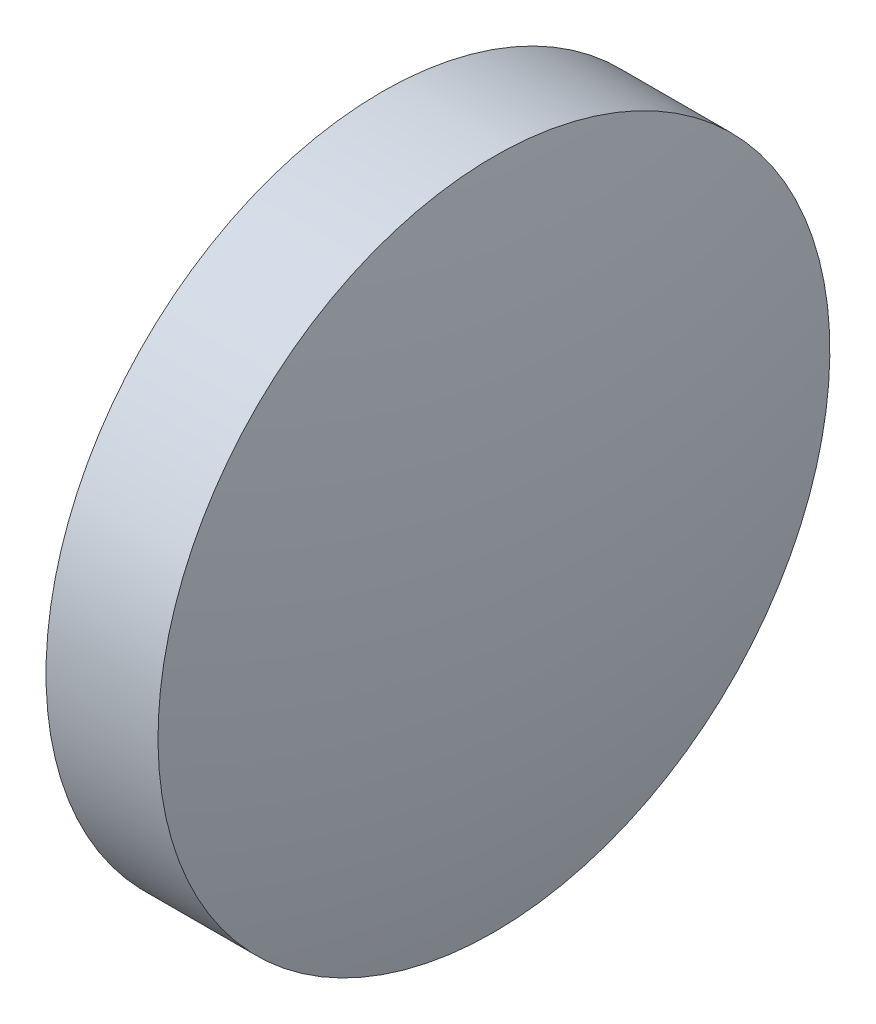
ISO-10303-21;
HEADER;
FILE_DESCRIPTION(('STEP AP214'),'2;1');
FILE_NAME('part.step','',(''),(''),'','','');
FILE_SCHEMA(('AUTOMOTIVE_DESIGN { 1 0 10303 214 1 1 1 1 }'));
ENDSEC;
DATA;
#1=APPLICATION_CONTEXT('core data for automotive mechanical design processes');
#2=APPLICATION_PROTOCOL_DEFINITION('international standard','automotive_design',2000,#1);
#3=PRODUCT_CONTEXT('',#1,'mechanical');
#4=PRODUCT('Part','Part','',(#3));
#5=PRODUCT_RELATED_PRODUCT_CATEGORY('part','',(#4));
#6=PRODUCT_DEFINITION_FORMATION('','',#4);
#7=PRODUCT_DEFINITION_CONTEXT('part definition',#1,'design');
#8=PRODUCT_DEFINITION('design','',#6,#7);
#9=PRODUCT_DEFINITION_SHAPE('','',#8);
#10=(LENGTH_UNIT() NAMED_UNIT(*) SI_UNIT(.MILLI.,.METRE.));
#11=(NAMED_UNIT(*) PLANE_ANGLE_UNIT() SI_UNIT($,.RADIAN.));
#12=(NAMED_UNIT(*) SI_UNIT($,.STERADIAN.) SOLID_ANGLE_UNIT());
#13=UNCERTAINTY_MEASURE_WITH_UNIT(LENGTH_MEASURE(1.E-05),#10,'distance_accuracy_value','');
#14=(GEOMETRIC_REPRESENTATION_CONTEXT(3) GLOBAL_UNCERTAINTY_ASSIGNED_CONTEXT((#13)) GLOBAL_UNIT_ASSIGNED_CONTEXT((#10,
#11,#12)) REPRESENTATION_CONTEXT('',''));
#15=CARTESIAN_POINT('',(0.,0.,0.));
#16=DIRECTION('',(0.,0.,1.));
#17=DIRECTION('',(1.,0.,0.));
#18=AXIS2_PLACEMENT_3D('',#15,#16,#17);
#19=CARTESIAN_POINT('',(34.0516103904647,11.4841211865791,0.));
#20=DIRECTION('',(-1.,0.,0.));
#21=DIRECTION('',(0.,1.,0.));
#22=AXIS2_PLACEMENT_3D('',#19,#20,#21);
#23=SPHERICAL_SURFACE('',#22,14.4434103534802);
#24=CARTESIAN_POINT('',(19.9231956655558,11.4841211865791,0.));
#25=DIRECTION('',(-1.,0.,0.));
#26=DIRECTION('',(0.,-1.,0.));
#27=AXIS2_PLACEMENT_3D('',#24,#25,#26);
#28=CIRCLE('',#27,3.);
#29=CARTESIAN_POINT('',(19.9231956655558,8.48412118657908,0.));
#30=VERTEX_POINT('',#29);
#31=EDGE_CURVE('E44',#30,#30,#28,.T.);
#32=ORIENTED_EDGE('',*,*,#31,.T.);
#33=EDGE_LOOP('',(#32));
#34=FACE_BOUND('',#33,.T.);
#35=ADVANCED_FACE('F37',(#34),#23,.T.);
#36=CARTESIAN_POINT('',(6.79478036921858,11.4841211865791,0.));
#37=DIRECTION('',(-1.,0.,0.));
#38=DIRECTION('',(0.,-1.,0.));
#39=AXIS2_PLACEMENT_3D('',#36,#37,#38);
#40=SPHERICAL_SURFACE('',#39,14.4434103534801);
#41=CARTESIAN_POINT('',(20.9231950941273,11.4841211865791,0.));
#42=DIRECTION('',(-1.,0.,0.));
#43=DIRECTION('',(0.,-1.,0.));
#44=AXIS2_PLACEMENT_3D('',#41,#42,#43);
#45=CIRCLE('',#44,3.);
#46=CARTESIAN_POINT('',(20.9231950941273,8.48412118657909,0.));
#47=VERTEX_POINT('',#46);
#48=EDGE_CURVE('E10',#47,#47,#45,.T.);
#49=ORIENTED_EDGE('',*,*,#48,.F.);
#50=EDGE_LOOP('',(#49));
#51=FACE_BOUND('',#50,.T.);
#52=ADVANCED_FACE('F54',(#51),#40,.T.);
#53=CARTESIAN_POINT('',(19.3223736875393,11.4841211865791,0.));
#54=DIRECTION('',(-1.,0.,0.));
#55=DIRECTION('',(0.,-1.,0.));
#56=AXIS2_PLACEMENT_3D('',#53,#54,#55);
#57=CYLINDRICAL_SURFACE('',#56,3.);
#58=ORIENTED_EDGE('',*,*,#48,.T.);
#59=EDGE_LOOP('',(#58));
#60=FACE_BOUND('',#59,.T.);
#61=ORIENTED_EDGE('',*,*,#31,.F.);
#62=EDGE_LOOP('',(#61));
#63=FACE_BOUND('',#62,.T.);
#64=ADVANCED_FACE('F52',(#60,#63),#57,.T.);
#65=CLOSED_SHELL('',(#35,#52,#64));
#66=MANIFOLD_SOLID_BREP('B2',#65);
#67=ADVANCED_BREP_SHAPE_REPRESENTATION('',(#18,#66),#14);
#68=SHAPE_DEFINITION_REPRESENTATION(#9,#67);
ENDSEC;
END-ISO-10303-21;
